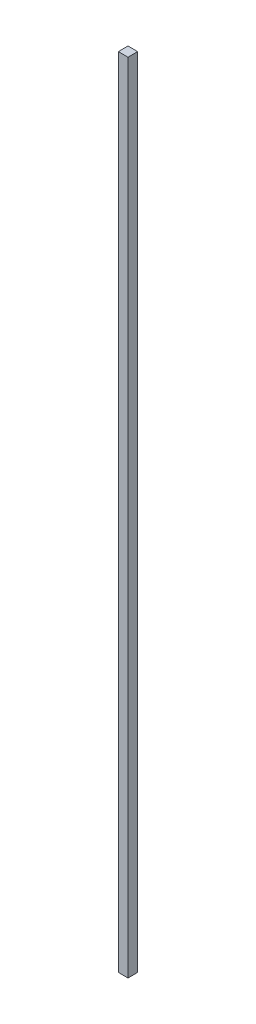
ISO-10303-21;
HEADER;
FILE_DESCRIPTION(('STEP AP214'),'2;1');
FILE_NAME('part.step','',(''),(''),'','','');
FILE_SCHEMA(('AUTOMOTIVE_DESIGN { 1 0 10303 214 1 1 1 1 }'));
ENDSEC;
DATA;
#1=APPLICATION_CONTEXT('core data for automotive mechanical design processes');
#2=APPLICATION_PROTOCOL_DEFINITION('international standard','automotive_design',2000,#1);
#3=PRODUCT_CONTEXT('',#1,'mechanical');
#4=PRODUCT('Part','Part','',(#3));
#5=PRODUCT_RELATED_PRODUCT_CATEGORY('part','',(#4));
#6=PRODUCT_DEFINITION_FORMATION('','',#4);
#7=PRODUCT_DEFINITION_CONTEXT('part definition',#1,'design');
#8=PRODUCT_DEFINITION('design','',#6,#7);
#9=PRODUCT_DEFINITION_SHAPE('','',#8);
#10=(LENGTH_UNIT() NAMED_UNIT(*) SI_UNIT(.MILLI.,.METRE.));
#11=(NAMED_UNIT(*) PLANE_ANGLE_UNIT() SI_UNIT($,.RADIAN.));
#12=(NAMED_UNIT(*) SI_UNIT($,.STERADIAN.) SOLID_ANGLE_UNIT());
#13=UNCERTAINTY_MEASURE_WITH_UNIT(LENGTH_MEASURE(1.E-05),#10,'distance_accuracy_value','');
#14=(GEOMETRIC_REPRESENTATION_CONTEXT(3) GLOBAL_UNCERTAINTY_ASSIGNED_CONTEXT((#13)) GLOBAL_UNIT_ASSIGNED_CONTEXT((#10,
#11,#12)) REPRESENTATION_CONTEXT('',''));
#15=CARTESIAN_POINT('',(0.,0.,0.));
#16=DIRECTION('',(0.,0.,1.));
#17=DIRECTION('',(1.,0.,0.));
#18=AXIS2_PLACEMENT_3D('',#15,#16,#17);
#19=CARTESIAN_POINT('',(15.,0.,-30.));
#20=DIRECTION('',(0.,1.,0.));
#21=DIRECTION('',(0.,0.,1.));
#22=AXIS2_PLACEMENT_3D('',#19,#20,#21);
#23=PLANE('',#22);
#24=DIRECTION('',(0.,0.,-1.));
#25=VECTOR('',#24,1.);
#26=CARTESIAN_POINT('',(-15.,0.,-30.));
#27=LINE('',#26,#25);
#28=CARTESIAN_POINT('',(-15.,0.,0.));
#29=VERTEX_POINT('',#28);
#30=CARTESIAN_POINT('',(-15.,0.,-30.));
#31=VERTEX_POINT('',#30);
#32=EDGE_CURVE('E98',#29,#31,#27,.T.);
#33=ORIENTED_EDGE('',*,*,#32,.T.);
#34=DIRECTION('',(-1.,0.,0.));
#35=VECTOR('',#34,1.);
#36=CARTESIAN_POINT('',(15.,0.,-30.));
#37=LINE('',#36,#35);
#38=CARTESIAN_POINT('',(15.,0.,-30.));
#39=VERTEX_POINT('',#38);
#40=EDGE_CURVE('E40',#39,#31,#37,.T.);
#41=ORIENTED_EDGE('',*,*,#40,.F.);
#42=DIRECTION('',(0.,0.,-1.));
#43=VECTOR('',#42,1.);
#44=CARTESIAN_POINT('',(15.,0.,-30.));
#45=LINE('',#44,#43);
#46=CARTESIAN_POINT('',(15.,0.,0.));
#47=VERTEX_POINT('',#46);
#48=EDGE_CURVE('E84',#47,#39,#45,.T.);
#49=ORIENTED_EDGE('',*,*,#48,.F.);
#50=DIRECTION('',(-1.,0.,0.));
#51=VECTOR('',#50,1.);
#52=CARTESIAN_POINT('',(15.,0.,0.));
#53=LINE('',#52,#51);
#54=EDGE_CURVE('E94',#47,#29,#53,.T.);
#55=ORIENTED_EDGE('',*,*,#54,.T.);
#56=EDGE_LOOP('',(#33,#41,#49,#55));
#57=FACE_BOUND('',#56,.T.);
#58=CARTESIAN_POINT('',(0.,0.,-15.));
#59=DIRECTION('',(0.,1.,0.));
#60=DIRECTION('',(0.,0.,1.));
#61=AXIS2_PLACEMENT_3D('',#58,#59,#60);
#62=CIRCLE('',#61,2.5);
#63=CARTESIAN_POINT('',(0.,0.,-12.5));
#64=VERTEX_POINT('',#63);
#65=EDGE_CURVE('E11',#64,#64,#62,.F.);
#66=ORIENTED_EDGE('',*,*,#65,.F.);
#67=EDGE_LOOP('',(#66));
#68=FACE_BOUND('',#67,.T.);
#69=ADVANCED_FACE('F32',(#57,#68),#23,.F.);
#70=CARTESIAN_POINT('',(15.,2470.,-29.9999999999997));
#71=DIRECTION('',(0.,0.,1.));
#72=DIRECTION('',(0.,-1.,0.));
#73=AXIS2_PLACEMENT_3D('',#70,#71,#72);
#74=PLANE('',#73);
#75=DIRECTION('',(0.,1.,0.));
#76=VECTOR('',#75,1.);
#77=CARTESIAN_POINT('',(-15.,2470.,-29.9999999999997));
#78=LINE('',#77,#76);
#79=CARTESIAN_POINT('',(-15.,2470.,-29.9999999999997));
#80=VERTEX_POINT('',#79);
#81=EDGE_CURVE('E89',#31,#80,#78,.T.);
#82=ORIENTED_EDGE('',*,*,#81,.T.);
#83=DIRECTION('',(-1.,0.,0.));
#84=VECTOR('',#83,1.);
#85=CARTESIAN_POINT('',(15.,2470.,-29.9999999999997));
#86=LINE('',#85,#84);
#87=CARTESIAN_POINT('',(15.,2470.,-29.9999999999997));
#88=VERTEX_POINT('',#87);
#89=EDGE_CURVE('E87',#88,#80,#86,.T.);
#90=ORIENTED_EDGE('',*,*,#89,.F.);
#91=DIRECTION('',(0.,1.,0.));
#92=VECTOR('',#91,1.);
#93=CARTESIAN_POINT('',(15.,2470.,-29.9999999999997));
#94=LINE('',#93,#92);
#95=EDGE_CURVE('E79',#39,#88,#94,.T.);
#96=ORIENTED_EDGE('',*,*,#95,.F.);
#97=ORIENTED_EDGE('',*,*,#40,.T.);
#98=EDGE_LOOP('',(#82,#90,#96,#97));
#99=FACE_BOUND('',#98,.T.);
#100=ADVANCED_FACE('F88',(#99),#74,.F.);
#101=CARTESIAN_POINT('',(15.,2470.,0.));
#102=DIRECTION('',(0.,-1.,0.));
#103=DIRECTION('',(0.,0.,-1.));
#104=AXIS2_PLACEMENT_3D('',#101,#102,#103);
#105=PLANE('',#104);
#106=DIRECTION('',(0.,0.,1.));
#107=VECTOR('',#106,1.);
#108=CARTESIAN_POINT('',(-15.,2470.,0.));
#109=LINE('',#108,#107);
#110=CARTESIAN_POINT('',(-15.,2470.,0.));
#111=VERTEX_POINT('',#110);
#112=EDGE_CURVE('E65',#80,#111,#109,.T.);
#113=ORIENTED_EDGE('',*,*,#112,.T.);
#114=DIRECTION('',(-1.,0.,0.));
#115=VECTOR('',#114,1.);
#116=CARTESIAN_POINT('',(15.,2470.,0.));
#117=LINE('',#116,#115);
#118=CARTESIAN_POINT('',(15.,2470.,0.));
#119=VERTEX_POINT('',#118);
#120=EDGE_CURVE('E90',#119,#111,#117,.T.);
#121=ORIENTED_EDGE('',*,*,#120,.F.);
#122=DIRECTION('',(0.,0.,1.));
#123=VECTOR('',#122,1.);
#124=CARTESIAN_POINT('',(15.,2470.,0.));
#125=LINE('',#124,#123);
#126=EDGE_CURVE('E82',#88,#119,#125,.T.);
#127=ORIENTED_EDGE('',*,*,#126,.F.);
#128=ORIENTED_EDGE('',*,*,#89,.T.);
#129=EDGE_LOOP('',(#113,#121,#127,#128));
#130=FACE_BOUND('',#129,.T.);
#131=ADVANCED_FACE('F92',(#130),#105,.F.);
#132=CARTESIAN_POINT('',(15.,0.,0.));
#133=DIRECTION('',(0.,0.,-1.));
#134=DIRECTION('',(-1.,0.,0.));
#135=AXIS2_PLACEMENT_3D('',#132,#133,#134);
#136=PLANE('',#135);
#137=DIRECTION('',(0.,-1.,0.));
#138=VECTOR('',#137,1.);
#139=CARTESIAN_POINT('',(-15.,0.,0.));
#140=LINE('',#139,#138);
#141=EDGE_CURVE('E71',#111,#29,#140,.T.);
#142=ORIENTED_EDGE('',*,*,#141,.T.);
#143=ORIENTED_EDGE('',*,*,#54,.F.);
#144=DIRECTION('',(0.,-1.,0.));
#145=VECTOR('',#144,1.);
#146=CARTESIAN_POINT('',(15.,0.,0.));
#147=LINE('',#146,#145);
#148=EDGE_CURVE('E48',#119,#47,#147,.T.);
#149=ORIENTED_EDGE('',*,*,#148,.F.);
#150=ORIENTED_EDGE('',*,*,#120,.T.);
#151=EDGE_LOOP('',(#142,#143,#149,#150));
#152=FACE_BOUND('',#151,.T.);
#153=ADVANCED_FACE('F122',(#152),#136,.F.);
#154=CARTESIAN_POINT('',(15.,0.,0.));
#155=DIRECTION('',(-1.,0.,0.));
#156=DIRECTION('',(0.,0.,1.));
#157=AXIS2_PLACEMENT_3D('',#154,#155,#156);
#158=PLANE('',#157);
#159=ORIENTED_EDGE('',*,*,#48,.T.);
#160=ORIENTED_EDGE('',*,*,#95,.T.);
#161=ORIENTED_EDGE('',*,*,#126,.T.);
#162=ORIENTED_EDGE('',*,*,#148,.T.);
#163=EDGE_LOOP('',(#159,#160,#161,#162));
#164=FACE_BOUND('',#163,.T.);
#165=ADVANCED_FACE('F80',(#164),#158,.F.);
#166=CARTESIAN_POINT('',(-15.,0.,0.));
#167=DIRECTION('',(-1.,0.,0.));
#168=DIRECTION('',(0.,0.,1.));
#169=AXIS2_PLACEMENT_3D('',#166,#167,#168);
#170=PLANE('',#169);
#171=ORIENTED_EDGE('',*,*,#32,.F.);
#172=ORIENTED_EDGE('',*,*,#141,.F.);
#173=ORIENTED_EDGE('',*,*,#112,.F.);
#174=ORIENTED_EDGE('',*,*,#81,.F.);
#175=EDGE_LOOP('',(#171,#172,#173,#174));
#176=FACE_BOUND('',#175,.T.);
#177=ADVANCED_FACE('F110',(#176),#170,.T.);
#178=CARTESIAN_POINT('',(0.,-10.,-15.));
#179=DIRECTION('',(0.,1.,0.));
#180=DIRECTION('',(0.,0.,1.));
#181=AXIS2_PLACEMENT_3D('',#178,#179,#180);
#182=CYLINDRICAL_SURFACE('',#181,2.5);
#183=CARTESIAN_POINT('',(0.,-10.,-15.));
#184=DIRECTION('',(0.,-1.,0.));
#185=DIRECTION('',(0.,0.,-1.));
#186=AXIS2_PLACEMENT_3D('',#183,#184,#185);
#187=CIRCLE('',#186,2.5);
#188=CARTESIAN_POINT('',(0.,-10.,-17.5));
#189=VERTEX_POINT('',#188);
#190=EDGE_CURVE('E101',#189,#189,#187,.T.);
#191=ORIENTED_EDGE('',*,*,#190,.F.);
#192=EDGE_LOOP('',(#191));
#193=FACE_BOUND('',#192,.T.);
#194=ORIENTED_EDGE('',*,*,#65,.T.);
#195=EDGE_LOOP('',(#194));
#196=FACE_BOUND('',#195,.T.);
#197=ADVANCED_FACE('F112',(#193,#196),#182,.T.);
#198=CARTESIAN_POINT('',(0.,-10.,-15.));
#199=DIRECTION('',(0.,-1.,0.));
#200=DIRECTION('',(0.,0.,-1.));
#201=AXIS2_PLACEMENT_3D('',#198,#199,#200);
#202=PLANE('',#201);
#203=ORIENTED_EDGE('',*,*,#190,.T.);
#204=EDGE_LOOP('',(#203));
#205=FACE_BOUND('',#204,.T.);
#206=ADVANCED_FACE('F119',(#205),#202,.T.);
#207=CLOSED_SHELL('',(#69,#100,#131,#153,#165,#177,#197,#206));
#208=MANIFOLD_SOLID_BREP('B2',#207);
#209=ADVANCED_BREP_SHAPE_REPRESENTATION('',(#18,#208),#14);
#210=SHAPE_DEFINITION_REPRESENTATION(#9,#209);
ENDSEC;
END-ISO-10303-21;
